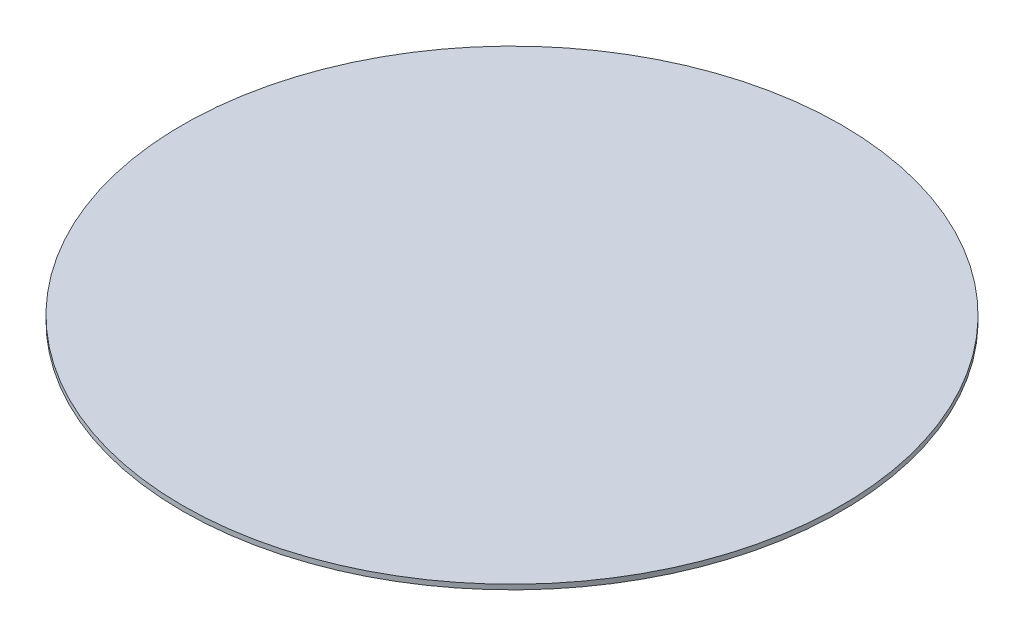
ISO-10303-21;
HEADER;
FILE_DESCRIPTION(('STEP AP214'),'2;1');
FILE_NAME('part.step','',(''),(''),'','','');
FILE_SCHEMA(('AUTOMOTIVE_DESIGN { 1 0 10303 214 1 1 1 1 }'));
ENDSEC;
DATA;
#1=APPLICATION_CONTEXT('core data for automotive mechanical design processes');
#2=APPLICATION_PROTOCOL_DEFINITION('international standard','automotive_design',2000,#1);
#3=PRODUCT_CONTEXT('',#1,'mechanical');
#4=PRODUCT('Part','Part','',(#3));
#5=PRODUCT_RELATED_PRODUCT_CATEGORY('part','',(#4));
#6=PRODUCT_DEFINITION_FORMATION('','',#4);
#7=PRODUCT_DEFINITION_CONTEXT('part definition',#1,'design');
#8=PRODUCT_DEFINITION('design','',#6,#7);
#9=PRODUCT_DEFINITION_SHAPE('','',#8);
#10=(LENGTH_UNIT() NAMED_UNIT(*) SI_UNIT(.MILLI.,.METRE.));
#11=(NAMED_UNIT(*) PLANE_ANGLE_UNIT() SI_UNIT($,.RADIAN.));
#12=(NAMED_UNIT(*) SI_UNIT($,.STERADIAN.) SOLID_ANGLE_UNIT());
#13=UNCERTAINTY_MEASURE_WITH_UNIT(LENGTH_MEASURE(1.E-05),#10,'distance_accuracy_value','');
#14=(GEOMETRIC_REPRESENTATION_CONTEXT(3) GLOBAL_UNCERTAINTY_ASSIGNED_CONTEXT((#13)) GLOBAL_UNIT_ASSIGNED_CONTEXT((#10,
#11,#12)) REPRESENTATION_CONTEXT('',''));
#15=CARTESIAN_POINT('',(0.,0.,0.));
#16=DIRECTION('',(0.,0.,1.));
#17=DIRECTION('',(1.,0.,0.));
#18=AXIS2_PLACEMENT_3D('',#15,#16,#17);
#19=CARTESIAN_POINT('',(0.,1.,0.));
#20=DIRECTION('',(0.,-1.,0.));
#21=DIRECTION('',(0.,0.,-1.));
#22=AXIS2_PLACEMENT_3D('',#19,#20,#21);
#23=CYLINDRICAL_SURFACE('',#22,67.5);
#24=CARTESIAN_POINT('',(0.,1.,0.));
#25=DIRECTION('',(0.,1.,0.));
#26=DIRECTION('',(0.,0.,1.));
#27=AXIS2_PLACEMENT_3D('',#24,#25,#26);
#28=CIRCLE('',#27,67.5);
#29=CARTESIAN_POINT('',(0.,1.,67.5));
#30=VERTEX_POINT('',#29);
#31=EDGE_CURVE('E10',#30,#30,#28,.T.);
#32=ORIENTED_EDGE('',*,*,#31,.F.);
#33=EDGE_LOOP('',(#32));
#34=FACE_BOUND('',#33,.T.);
#35=CARTESIAN_POINT('',(0.,0.,0.));
#36=DIRECTION('',(0.,1.,0.));
#37=DIRECTION('',(0.,0.,1.));
#38=AXIS2_PLACEMENT_3D('',#35,#36,#37);
#39=CIRCLE('',#38,67.5);
#40=CARTESIAN_POINT('',(0.,0.,67.5));
#41=VERTEX_POINT('',#40);
#42=EDGE_CURVE('E34',#41,#41,#39,.T.);
#43=ORIENTED_EDGE('',*,*,#42,.T.);
#44=EDGE_LOOP('',(#43));
#45=FACE_BOUND('',#44,.T.);
#46=ADVANCED_FACE('F31',(#34,#45),#23,.T.);
#47=CARTESIAN_POINT('',(0.,1.,0.));
#48=DIRECTION('',(0.,1.,0.));
#49=DIRECTION('',(0.,0.,1.));
#50=AXIS2_PLACEMENT_3D('',#47,#48,#49);
#51=PLANE('',#50);
#52=ORIENTED_EDGE('',*,*,#31,.T.);
#53=EDGE_LOOP('',(#52));
#54=FACE_BOUND('',#53,.T.);
#55=ADVANCED_FACE('F46',(#54),#51,.T.);
#56=CARTESIAN_POINT('',(0.,0.,0.));
#57=DIRECTION('',(0.,1.,0.));
#58=DIRECTION('',(0.,0.,1.));
#59=AXIS2_PLACEMENT_3D('',#56,#57,#58);
#60=PLANE('',#59);
#61=ORIENTED_EDGE('',*,*,#42,.F.);
#62=EDGE_LOOP('',(#61));
#63=FACE_BOUND('',#62,.T.);
#64=ADVANCED_FACE('F44',(#63),#60,.F.);
#65=CLOSED_SHELL('',(#46,#55,#64));
#66=MANIFOLD_SOLID_BREP('B2',#65);
#67=ADVANCED_BREP_SHAPE_REPRESENTATION('',(#18,#66),#14);
#68=SHAPE_DEFINITION_REPRESENTATION(#9,#67);
ENDSEC;
END-ISO-10303-21;
